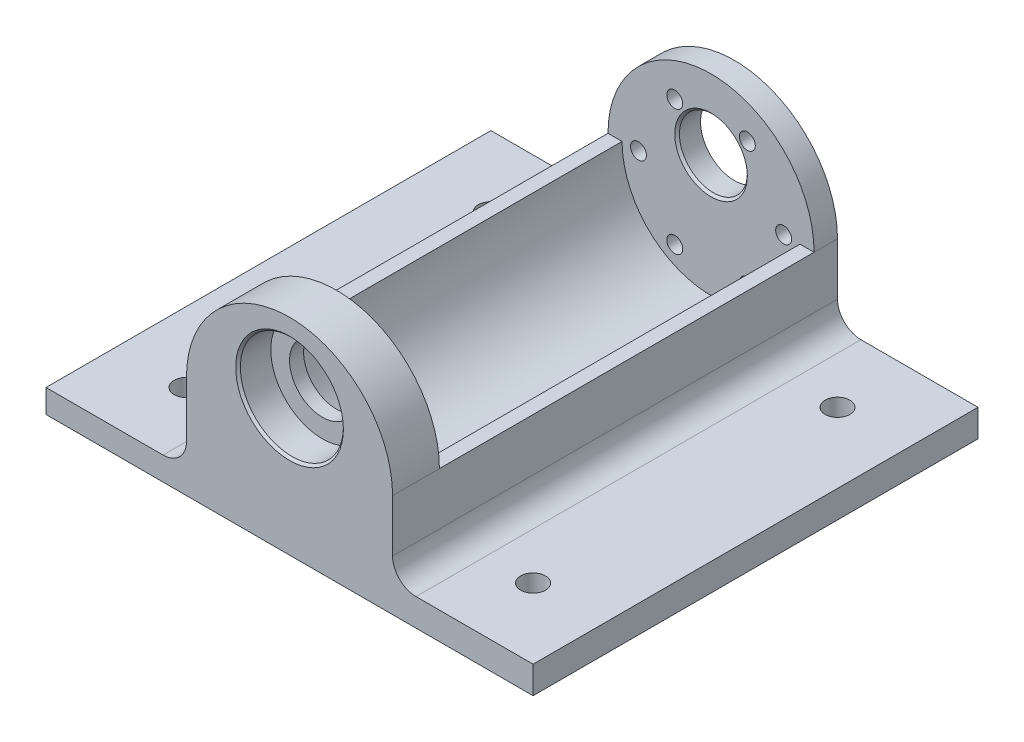
ISO-10303-21;
HEADER;
FILE_DESCRIPTION(('STEP AP214'),'2;1');
FILE_NAME('part.step','',(''),(''),'','','');
FILE_SCHEMA(('AUTOMOTIVE_DESIGN { 1 0 10303 214 1 1 1 1 }'));
ENDSEC;
DATA;
#1=APPLICATION_CONTEXT('core data for automotive mechanical design processes');
#2=APPLICATION_PROTOCOL_DEFINITION('international standard','automotive_design',2000,#1);
#3=PRODUCT_CONTEXT('',#1,'mechanical');
#4=PRODUCT('Part','Part','',(#3));
#5=PRODUCT_RELATED_PRODUCT_CATEGORY('part','',(#4));
#6=PRODUCT_DEFINITION_FORMATION('','',#4);
#7=PRODUCT_DEFINITION_CONTEXT('part definition',#1,'design');
#8=PRODUCT_DEFINITION('design','',#6,#7);
#9=PRODUCT_DEFINITION_SHAPE('','',#8);
#10=(LENGTH_UNIT() NAMED_UNIT(*) SI_UNIT(.MILLI.,.METRE.));
#11=(NAMED_UNIT(*) PLANE_ANGLE_UNIT() SI_UNIT($,.RADIAN.));
#12=(NAMED_UNIT(*) SI_UNIT($,.STERADIAN.) SOLID_ANGLE_UNIT());
#13=UNCERTAINTY_MEASURE_WITH_UNIT(LENGTH_MEASURE(1.E-05),#10,'distance_accuracy_value','');
#14=(GEOMETRIC_REPRESENTATION_CONTEXT(3) GLOBAL_UNCERTAINTY_ASSIGNED_CONTEXT((#13)) GLOBAL_UNIT_ASSIGNED_CONTEXT((#10,
#11,#12)) REPRESENTATION_CONTEXT('',''));
#15=CARTESIAN_POINT('',(0.,0.,0.));
#16=DIRECTION('',(0.,0.,1.));
#17=DIRECTION('',(1.,0.,0.));
#18=AXIS2_PLACEMENT_3D('',#15,#16,#17);
#19=CARTESIAN_POINT('',(-22.,0.,5.));
#20=DIRECTION('',(1.,0.,0.));
#21=DIRECTION('',(0.,0.,-1.));
#22=AXIS2_PLACEMENT_3D('',#19,#20,#21);
#23=PLANE('',#22);
#24=DIRECTION('',(0.,-1.,0.));
#25=VECTOR('',#24,1.);
#26=CARTESIAN_POINT('',(-22.,0.,0.));
#27=LINE('',#26,#25);
#28=CARTESIAN_POINT('',(-22.,0.,0.));
#29=VERTEX_POINT('',#28);
#30=CARTESIAN_POINT('',(-22.,-12.,0.));
#31=VERTEX_POINT('',#30);
#32=EDGE_CURVE('E164',#29,#31,#27,.T.);
#33=ORIENTED_EDGE('',*,*,#32,.T.);
#34=DIRECTION('',(0.,0.,-1.));
#35=VECTOR('',#34,1.);
#36=CARTESIAN_POINT('',(-22.,-12.,95.));
#37=LINE('',#36,#35);
#38=CARTESIAN_POINT('',(-22.,-12.,95.));
#39=VERTEX_POINT('',#38);
#40=EDGE_CURVE('E348',#31,#39,#37,.F.);
#41=ORIENTED_EDGE('',*,*,#40,.T.);
#42=DIRECTION('',(0.,-1.,0.));
#43=VECTOR('',#42,1.);
#44=CARTESIAN_POINT('',(-22.,0.,95.));
#45=LINE('',#44,#43);
#46=CARTESIAN_POINT('',(-22.,0.,95.));
#47=VERTEX_POINT('',#46);
#48=EDGE_CURVE('E219',#47,#39,#45,.T.);
#49=ORIENTED_EDGE('',*,*,#48,.F.);
#50=DIRECTION('',(0.,0.,-1.));
#51=VECTOR('',#50,1.);
#52=CARTESIAN_POINT('',(-22.,0.,95.));
#53=LINE('',#52,#51);
#54=CARTESIAN_POINT('',(-22.,0.,85.));
#55=VERTEX_POINT('',#54);
#56=EDGE_CURVE('E230',#47,#55,#53,.T.);
#57=ORIENTED_EDGE('',*,*,#56,.T.);
#58=DIRECTION('',(0.,0.,-1.));
#59=VECTOR('',#58,1.);
#60=CARTESIAN_POINT('',(-22.,0.,85.));
#61=LINE('',#60,#59);
#62=CARTESIAN_POINT('',(-22.,0.,5.));
#63=VERTEX_POINT('',#62);
#64=EDGE_CURVE('E257',#55,#63,#61,.T.);
#65=ORIENTED_EDGE('',*,*,#64,.T.);
#66=DIRECTION('',(0.,0.,-1.));
#67=VECTOR('',#66,1.);
#68=CARTESIAN_POINT('',(-22.,0.,5.));
#69=LINE('',#68,#67);
#70=EDGE_CURVE('E323',#63,#29,#69,.T.);
#71=ORIENTED_EDGE('',*,*,#70,.T.);
#72=EDGE_LOOP('',(#33,#41,#49,#57,#65,#71));
#73=FACE_BOUND('',#72,.T.);
#74=ADVANCED_FACE('F50',(#73),#23,.F.);
#75=CARTESIAN_POINT('',(22.,0.,5.));
#76=DIRECTION('',(1.,0.,0.));
#77=DIRECTION('',(0.,0.,-1.));
#78=AXIS2_PLACEMENT_3D('',#75,#76,#77);
#79=PLANE('',#78);
#80=DIRECTION('',(0.,-1.,0.));
#81=VECTOR('',#80,1.);
#82=CARTESIAN_POINT('',(22.,0.,95.));
#83=LINE('',#82,#81);
#84=CARTESIAN_POINT('',(22.,0.,95.));
#85=VERTEX_POINT('',#84);
#86=CARTESIAN_POINT('',(22.,-11.161685475024,95.));
#87=VERTEX_POINT('',#86);
#88=EDGE_CURVE('E223',#85,#87,#83,.T.);
#89=ORIENTED_EDGE('',*,*,#88,.T.);
#90=DIRECTION('',(0.,0.,1.));
#91=VECTOR('',#90,1.);
#92=CARTESIAN_POINT('',(22.,-11.161685475024,5.));
#93=LINE('',#92,#91);
#94=CARTESIAN_POINT('',(22.,-11.161685475024,0.));
#95=VERTEX_POINT('',#94);
#96=EDGE_CURVE('E66',#87,#95,#93,.F.);
#97=ORIENTED_EDGE('',*,*,#96,.T.);
#98=DIRECTION('',(0.,-1.,0.));
#99=VECTOR('',#98,1.);
#100=CARTESIAN_POINT('',(22.,0.,0.));
#101=LINE('',#100,#99);
#102=CARTESIAN_POINT('',(22.,0.,0.));
#103=VERTEX_POINT('',#102);
#104=EDGE_CURVE('E165',#103,#95,#101,.T.);
#105=ORIENTED_EDGE('',*,*,#104,.F.);
#106=DIRECTION('',(0.,0.,-1.));
#107=VECTOR('',#106,1.);
#108=CARTESIAN_POINT('',(22.,0.,5.));
#109=LINE('',#108,#107);
#110=CARTESIAN_POINT('',(22.,0.,5.));
#111=VERTEX_POINT('',#110);
#112=EDGE_CURVE('E329',#111,#103,#109,.T.);
#113=ORIENTED_EDGE('',*,*,#112,.F.);
#114=DIRECTION('',(0.,0.,-1.));
#115=VECTOR('',#114,1.);
#116=CARTESIAN_POINT('',(22.,0.,85.));
#117=LINE('',#116,#115);
#118=CARTESIAN_POINT('',(22.,0.,85.));
#119=VERTEX_POINT('',#118);
#120=EDGE_CURVE('E254',#119,#111,#117,.T.);
#121=ORIENTED_EDGE('',*,*,#120,.F.);
#122=DIRECTION('',(0.,0.,-1.));
#123=VECTOR('',#122,1.);
#124=CARTESIAN_POINT('',(22.,0.,95.));
#125=LINE('',#124,#123);
#126=EDGE_CURVE('E225',#85,#119,#125,.T.);
#127=ORIENTED_EDGE('',*,*,#126,.F.);
#128=EDGE_LOOP('',(#89,#97,#105,#113,#121,#127));
#129=FACE_BOUND('',#128,.T.);
#130=ADVANCED_FACE('F386',(#129),#79,.T.);
#131=CARTESIAN_POINT('',(0.,0.,5.));
#132=DIRECTION('',(0.,0.,1.));
#133=DIRECTION('',(1.,0.,0.));
#134=AXIS2_PLACEMENT_3D('',#131,#132,#133);
#135=PLANE('',#134);
#136=CARTESIAN_POINT('',(0.,7.,5.));
#137=DIRECTION('',(0.,0.,1.));
#138=DIRECTION('',(1.,0.,0.));
#139=AXIS2_PLACEMENT_3D('',#136,#137,#138);
#140=CIRCLE('',#139,7.74999999999999);
#141=CARTESIAN_POINT('',(7.74999999999999,7.,5.));
#142=VERTEX_POINT('',#141);
#143=EDGE_CURVE('E342',#142,#142,#140,.F.);
#144=ORIENTED_EDGE('',*,*,#143,.T.);
#145=EDGE_LOOP('',(#144));
#146=FACE_BOUND('',#145,.T.);
#147=DIRECTION('',(-1.,0.,0.));
#148=VECTOR('',#147,1.);
#149=CARTESIAN_POINT('',(19.,0.,5.));
#150=LINE('',#149,#148);
#151=CARTESIAN_POINT('',(19.,0.,5.));
#152=VERTEX_POINT('',#151);
#153=EDGE_CURVE('E238',#111,#152,#150,.T.);
#154=ORIENTED_EDGE('',*,*,#153,.F.);
#155=CARTESIAN_POINT('',(0.,0.,5.));
#156=DIRECTION('',(0.,0.,1.));
#157=DIRECTION('',(1.,0.,0.));
#158=AXIS2_PLACEMENT_3D('',#155,#156,#157);
#159=CIRCLE('',#158,22.);
#160=EDGE_CURVE('E320',#111,#63,#159,.T.);
#161=ORIENTED_EDGE('',*,*,#160,.T.);
#162=DIRECTION('',(-1.,0.,0.));
#163=VECTOR('',#162,1.);
#164=CARTESIAN_POINT('',(-19.,0.,5.));
#165=LINE('',#164,#163);
#166=CARTESIAN_POINT('',(-19.,0.,5.));
#167=VERTEX_POINT('',#166);
#168=EDGE_CURVE('E247',#167,#63,#165,.T.);
#169=ORIENTED_EDGE('',*,*,#168,.F.);
#170=CARTESIAN_POINT('',(0.,0.,5.));
#171=DIRECTION('',(0.,0.,-1.));
#172=DIRECTION('',(1.,0.,0.));
#173=AXIS2_PLACEMENT_3D('',#170,#171,#172);
#174=CIRCLE('',#173,19.);
#175=EDGE_CURVE('E233',#152,#167,#174,.T.);
#176=ORIENTED_EDGE('',*,*,#175,.F.);
#177=EDGE_LOOP('',(#154,#161,#169,#176));
#178=FACE_BOUND('',#177,.T.);
#179=CARTESIAN_POINT('',(15.5,0.,5.));
#180=DIRECTION('',(0.,0.,-1.));
#181=DIRECTION('',(-1.,0.,0.));
#182=AXIS2_PLACEMENT_3D('',#179,#180,#181);
#183=CIRCLE('',#182,1.7);
#184=CARTESIAN_POINT('',(13.8,0.,5.));
#185=VERTEX_POINT('',#184);
#186=EDGE_CURVE('E269',#185,#185,#183,.T.);
#187=ORIENTED_EDGE('',*,*,#186,.T.);
#188=EDGE_LOOP('',(#187));
#189=FACE_BOUND('',#188,.T.);
#190=CARTESIAN_POINT('',(-15.5,0.,5.));
#191=DIRECTION('',(0.,0.,-1.));
#192=DIRECTION('',(-1.,0.,0.));
#193=AXIS2_PLACEMENT_3D('',#190,#191,#192);
#194=CIRCLE('',#193,1.7);
#195=CARTESIAN_POINT('',(-17.2,0.,5.));
#196=VERTEX_POINT('',#195);
#197=EDGE_CURVE('E278',#196,#196,#194,.T.);
#198=ORIENTED_EDGE('',*,*,#197,.T.);
#199=EDGE_LOOP('',(#198));
#200=FACE_BOUND('',#199,.T.);
#201=CARTESIAN_POINT('',(-7.75,13.4233937586588,5.));
#202=DIRECTION('',(0.,0.,-1.));
#203=DIRECTION('',(-1.,0.,0.));
#204=AXIS2_PLACEMENT_3D('',#201,#202,#203);
#205=CIRCLE('',#204,1.7);
#206=CARTESIAN_POINT('',(-9.45,13.4233937586588,5.));
#207=VERTEX_POINT('',#206);
#208=EDGE_CURVE('E287',#207,#207,#205,.T.);
#209=ORIENTED_EDGE('',*,*,#208,.T.);
#210=EDGE_LOOP('',(#209));
#211=FACE_BOUND('',#210,.T.);
#212=CARTESIAN_POINT('',(7.75,13.4233937586588,5.));
#213=DIRECTION('',(0.,0.,-1.));
#214=DIRECTION('',(-1.,0.,0.));
#215=AXIS2_PLACEMENT_3D('',#212,#213,#214);
#216=CIRCLE('',#215,1.7);
#217=CARTESIAN_POINT('',(6.05,13.4233937586588,5.));
#218=VERTEX_POINT('',#217);
#219=EDGE_CURVE('E296',#218,#218,#216,.T.);
#220=ORIENTED_EDGE('',*,*,#219,.T.);
#221=EDGE_LOOP('',(#220));
#222=FACE_BOUND('',#221,.T.);
#223=CARTESIAN_POINT('',(7.75,-13.4233937586588,5.));
#224=DIRECTION('',(0.,0.,-1.));
#225=DIRECTION('',(-1.,0.,0.));
#226=AXIS2_PLACEMENT_3D('',#223,#224,#225);
#227=CIRCLE('',#226,1.7);
#228=CARTESIAN_POINT('',(6.05,-13.4233937586588,5.));
#229=VERTEX_POINT('',#228);
#230=EDGE_CURVE('E305',#229,#229,#227,.T.);
#231=ORIENTED_EDGE('',*,*,#230,.T.);
#232=EDGE_LOOP('',(#231));
#233=FACE_BOUND('',#232,.T.);
#234=CARTESIAN_POINT('',(-7.75,-13.4233937586588,5.));
#235=DIRECTION('',(0.,0.,-1.));
#236=DIRECTION('',(-1.,0.,0.));
#237=AXIS2_PLACEMENT_3D('',#234,#235,#236);
#238=CIRCLE('',#237,1.7);
#239=CARTESIAN_POINT('',(-9.45,-13.4233937586588,5.));
#240=VERTEX_POINT('',#239);
#241=EDGE_CURVE('E314',#240,#240,#238,.T.);
#242=ORIENTED_EDGE('',*,*,#241,.T.);
#243=EDGE_LOOP('',(#242));
#244=FACE_BOUND('',#243,.T.);
#245=ADVANCED_FACE('F374',(#146,#178,#189,#200,#211,#222,#233,#244),#135,.T.);
#246=CARTESIAN_POINT('',(0.,0.,0.));
#247=DIRECTION('',(0.,0.,1.));
#248=DIRECTION('',(1.,0.,0.));
#249=AXIS2_PLACEMENT_3D('',#246,#247,#248);
#250=PLANE('',#249);
#251=CARTESIAN_POINT('',(15.5,0.,0.));
#252=DIRECTION('',(0.,0.,-1.));
#253=DIRECTION('',(-1.,0.,0.));
#254=AXIS2_PLACEMENT_3D('',#251,#252,#253);
#255=CIRCLE('',#254,1.725);
#256=CARTESIAN_POINT('',(13.775,0.,0.));
#257=VERTEX_POINT('',#256);
#258=EDGE_CURVE('E263',#257,#257,#255,.T.);
#259=ORIENTED_EDGE('',*,*,#258,.F.);
#260=EDGE_LOOP('',(#259));
#261=FACE_BOUND('',#260,.T.);
#262=CARTESIAN_POINT('',(-15.5,0.,0.));
#263=DIRECTION('',(0.,0.,-1.));
#264=DIRECTION('',(-1.,0.,0.));
#265=AXIS2_PLACEMENT_3D('',#262,#263,#264);
#266=CIRCLE('',#265,1.725);
#267=CARTESIAN_POINT('',(-17.225,0.,0.));
#268=VERTEX_POINT('',#267);
#269=EDGE_CURVE('E272',#268,#268,#266,.T.);
#270=ORIENTED_EDGE('',*,*,#269,.F.);
#271=EDGE_LOOP('',(#270));
#272=FACE_BOUND('',#271,.T.);
#273=CARTESIAN_POINT('',(-7.75,13.4233937586588,0.));
#274=DIRECTION('',(0.,0.,-1.));
#275=DIRECTION('',(-1.,0.,0.));
#276=AXIS2_PLACEMENT_3D('',#273,#274,#275);
#277=CIRCLE('',#276,1.725);
#278=CARTESIAN_POINT('',(-9.475,13.4233937586588,0.));
#279=VERTEX_POINT('',#278);
#280=EDGE_CURVE('E281',#279,#279,#277,.T.);
#281=ORIENTED_EDGE('',*,*,#280,.F.);
#282=EDGE_LOOP('',(#281));
#283=FACE_BOUND('',#282,.T.);
#284=CARTESIAN_POINT('',(7.75,13.4233937586588,0.));
#285=DIRECTION('',(0.,0.,-1.));
#286=DIRECTION('',(-1.,0.,0.));
#287=AXIS2_PLACEMENT_3D('',#284,#285,#286);
#288=CIRCLE('',#287,1.725);
#289=CARTESIAN_POINT('',(6.025,13.4233937586588,0.));
#290=VERTEX_POINT('',#289);
#291=EDGE_CURVE('E290',#290,#290,#288,.T.);
#292=ORIENTED_EDGE('',*,*,#291,.F.);
#293=EDGE_LOOP('',(#292));
#294=FACE_BOUND('',#293,.T.);
#295=CARTESIAN_POINT('',(7.75,-13.4233937586588,0.));
#296=DIRECTION('',(0.,0.,-1.));
#297=DIRECTION('',(-1.,0.,0.));
#298=AXIS2_PLACEMENT_3D('',#295,#296,#297);
#299=CIRCLE('',#298,1.725);
#300=CARTESIAN_POINT('',(6.025,-13.4233937586588,0.));
#301=VERTEX_POINT('',#300);
#302=EDGE_CURVE('E299',#301,#301,#299,.T.);
#303=ORIENTED_EDGE('',*,*,#302,.F.);
#304=EDGE_LOOP('',(#303));
#305=FACE_BOUND('',#304,.T.);
#306=ORIENTED_EDGE('',*,*,#104,.T.);
#307=CARTESIAN_POINT('',(27.,-11.161685475024,0.));
#308=DIRECTION('',(0.,0.,1.));
#309=DIRECTION('',(1.,0.,0.));
#310=AXIS2_PLACEMENT_3D('',#307,#308,#309);
#311=CIRCLE('',#310,5.);
#312=CARTESIAN_POINT('',(27.,-16.161685475024,0.));
#313=VERTEX_POINT('',#312);
#314=EDGE_CURVE('E12',#95,#313,#311,.T.);
#315=ORIENTED_EDGE('',*,*,#314,.T.);
#316=DIRECTION('',(-1.,0.,0.));
#317=VECTOR('',#316,1.);
#318=CARTESIAN_POINT('',(52.,-16.161685475024,0.));
#319=LINE('',#318,#317);
#320=CARTESIAN_POINT('',(52.,-16.161685475024,0.));
#321=VERTEX_POINT('',#320);
#322=EDGE_CURVE('E203',#321,#313,#319,.T.);
#323=ORIENTED_EDGE('',*,*,#322,.F.);
#324=DIRECTION('',(0.,1.,0.));
#325=VECTOR('',#324,1.);
#326=CARTESIAN_POINT('',(52.,-22.,0.));
#327=LINE('',#326,#325);
#328=CARTESIAN_POINT('',(52.,-22.,0.));
#329=VERTEX_POINT('',#328);
#330=EDGE_CURVE('E160',#329,#321,#327,.T.);
#331=ORIENTED_EDGE('',*,*,#330,.F.);
#332=DIRECTION('',(-1.,0.,0.));
#333=VECTOR('',#332,1.);
#334=CARTESIAN_POINT('',(22.,-22.,0.));
#335=LINE('',#334,#333);
#336=CARTESIAN_POINT('',(-52.,-22.,0.));
#337=VERTEX_POINT('',#336);
#338=EDGE_CURVE('E152',#329,#337,#335,.T.);
#339=ORIENTED_EDGE('',*,*,#338,.T.);
#340=DIRECTION('',(0.,-1.,0.));
#341=VECTOR('',#340,1.);
#342=CARTESIAN_POINT('',(-52.,-22.,0.));
#343=LINE('',#342,#341);
#344=CARTESIAN_POINT('',(-52.,-17.,0.));
#345=VERTEX_POINT('',#344);
#346=EDGE_CURVE('E158',#345,#337,#343,.T.);
#347=ORIENTED_EDGE('',*,*,#346,.F.);
#348=DIRECTION('',(1.,0.,0.));
#349=VECTOR('',#348,1.);
#350=CARTESIAN_POINT('',(-52.,-17.,0.));
#351=LINE('',#350,#349);
#352=CARTESIAN_POINT('',(-27.,-17.,0.));
#353=VERTEX_POINT('',#352);
#354=EDGE_CURVE('E188',#345,#353,#351,.T.);
#355=ORIENTED_EDGE('',*,*,#354,.T.);
#356=CARTESIAN_POINT('',(-27.,-12.,0.));
#357=DIRECTION('',(0.,0.,1.));
#358=DIRECTION('',(1.,0.,0.));
#359=AXIS2_PLACEMENT_3D('',#356,#357,#358);
#360=CIRCLE('',#359,5.);
#361=EDGE_CURVE('E354',#353,#31,#360,.T.);
#362=ORIENTED_EDGE('',*,*,#361,.T.);
#363=ORIENTED_EDGE('',*,*,#32,.F.);
#364=CARTESIAN_POINT('',(0.,0.,0.));
#365=DIRECTION('',(0.,0.,1.));
#366=DIRECTION('',(1.,0.,0.));
#367=AXIS2_PLACEMENT_3D('',#364,#365,#366);
#368=CIRCLE('',#367,22.);
#369=EDGE_CURVE('E324',#103,#29,#368,.T.);
#370=ORIENTED_EDGE('',*,*,#369,.F.);
#371=EDGE_LOOP('',(#306,#315,#323,#331,#339,#347,#355,#362,#363,#370));
#372=FACE_BOUND('',#371,.T.);
#373=CARTESIAN_POINT('',(0.,7.,0.));
#374=DIRECTION('',(0.,0.,1.));
#375=DIRECTION('',(1.,0.,0.));
#376=AXIS2_PLACEMENT_3D('',#373,#374,#375);
#377=CIRCLE('',#376,7.25);
#378=CARTESIAN_POINT('',(7.25,7.,0.));
#379=VERTEX_POINT('',#378);
#380=EDGE_CURVE('E317',#379,#379,#377,.T.);
#381=ORIENTED_EDGE('',*,*,#380,.T.);
#382=EDGE_LOOP('',(#381));
#383=FACE_BOUND('',#382,.T.);
#384=CARTESIAN_POINT('',(-7.75,-13.4233937586588,0.));
#385=DIRECTION('',(0.,0.,-1.));
#386=DIRECTION('',(-1.,0.,0.));
#387=AXIS2_PLACEMENT_3D('',#384,#385,#386);
#388=CIRCLE('',#387,1.725);
#389=CARTESIAN_POINT('',(-9.475,-13.4233937586588,0.));
#390=VERTEX_POINT('',#389);
#391=EDGE_CURVE('E308',#390,#390,#388,.T.);
#392=ORIENTED_EDGE('',*,*,#391,.F.);
#393=EDGE_LOOP('',(#392));
#394=FACE_BOUND('',#393,.T.);
#395=ADVANCED_FACE('F154',(#261,#272,#283,#294,#305,#372,#383,#394),#250,.F.);
#396=CARTESIAN_POINT('',(0.,0.,5.));
#397=DIRECTION('',(0.,0.,-1.));
#398=DIRECTION('',(-1.,0.,0.));
#399=AXIS2_PLACEMENT_3D('',#396,#397,#398);
#400=CYLINDRICAL_SURFACE('',#399,22.);
#401=ORIENTED_EDGE('',*,*,#369,.T.);
#402=ORIENTED_EDGE('',*,*,#70,.F.);
#403=ORIENTED_EDGE('',*,*,#160,.F.);
#404=ORIENTED_EDGE('',*,*,#112,.T.);
#405=EDGE_LOOP('',(#401,#402,#403,#404));
#406=FACE_BOUND('',#405,.T.);
#407=ADVANCED_FACE('F372',(#406),#400,.T.);
#408=CARTESIAN_POINT('',(22.,-22.,5.));
#409=DIRECTION('',(0.,-1.,0.));
#410=DIRECTION('',(0.,0.,-1.));
#411=AXIS2_PLACEMENT_3D('',#408,#409,#410);
#412=PLANE('',#411);
#413=CARTESIAN_POINT('',(-37.,-22.,80.));
#414=DIRECTION('',(0.,-1.,0.));
#415=DIRECTION('',(0.,0.,-1.));
#416=AXIS2_PLACEMENT_3D('',#413,#414,#415);
#417=CIRCLE('',#416,2.64999999999999);
#418=CARTESIAN_POINT('',(-37.,-22.,77.35));
#419=VERTEX_POINT('',#418);
#420=EDGE_CURVE('E458',#419,#419,#417,.T.);
#421=ORIENTED_EDGE('',*,*,#420,.F.);
#422=EDGE_LOOP('',(#421));
#423=FACE_BOUND('',#422,.T.);
#424=CARTESIAN_POINT('',(37.,-22.,80.));
#425=DIRECTION('',(0.,-1.,0.));
#426=DIRECTION('',(0.,0.,-1.));
#427=AXIS2_PLACEMENT_3D('',#424,#425,#426);
#428=CIRCLE('',#427,2.64999999999999);
#429=CARTESIAN_POINT('',(37.,-22.,77.35));
#430=VERTEX_POINT('',#429);
#431=EDGE_CURVE('E461',#430,#430,#428,.T.);
#432=ORIENTED_EDGE('',*,*,#431,.F.);
#433=EDGE_LOOP('',(#432));
#434=FACE_BOUND('',#433,.T.);
#435=CARTESIAN_POINT('',(37.,-22.,15.));
#436=DIRECTION('',(0.,-1.,0.));
#437=DIRECTION('',(0.,0.,-1.));
#438=AXIS2_PLACEMENT_3D('',#435,#436,#437);
#439=CIRCLE('',#438,2.64999999999999);
#440=CARTESIAN_POINT('',(37.,-22.,12.35));
#441=VERTEX_POINT('',#440);
#442=EDGE_CURVE('E469',#441,#441,#439,.T.);
#443=ORIENTED_EDGE('',*,*,#442,.F.);
#444=EDGE_LOOP('',(#443));
#445=FACE_BOUND('',#444,.T.);
#446=CARTESIAN_POINT('',(-37.,-22.,15.));
#447=DIRECTION('',(0.,-1.,0.));
#448=DIRECTION('',(0.,0.,-1.));
#449=AXIS2_PLACEMENT_3D('',#446,#447,#448);
#450=CIRCLE('',#449,2.64999999999999);
#451=CARTESIAN_POINT('',(-37.,-22.,12.35));
#452=VERTEX_POINT('',#451);
#453=EDGE_CURVE('E182',#452,#452,#450,.T.);
#454=ORIENTED_EDGE('',*,*,#453,.F.);
#455=EDGE_LOOP('',(#454));
#456=FACE_BOUND('',#455,.T.);
#457=ORIENTED_EDGE('',*,*,#338,.F.);
#458=DIRECTION('',(0.,0.,-1.));
#459=VECTOR('',#458,1.);
#460=CARTESIAN_POINT('',(52.,-22.,95.));
#461=LINE('',#460,#459);
#462=CARTESIAN_POINT('',(52.,-22.,95.));
#463=VERTEX_POINT('',#462);
#464=EDGE_CURVE('E196',#463,#329,#461,.T.);
#465=ORIENTED_EDGE('',*,*,#464,.F.);
#466=DIRECTION('',(-1.,0.,0.));
#467=VECTOR('',#466,1.);
#468=CARTESIAN_POINT('',(22.,-22.,95.));
#469=LINE('',#468,#467);
#470=CARTESIAN_POINT('',(-52.,-22.,95.));
#471=VERTEX_POINT('',#470);
#472=EDGE_CURVE('E170',#463,#471,#469,.T.);
#473=ORIENTED_EDGE('',*,*,#472,.T.);
#474=DIRECTION('',(0.,0.,1.));
#475=VECTOR('',#474,1.);
#476=CARTESIAN_POINT('',(-52.,-22.,0.));
#477=LINE('',#476,#475);
#478=EDGE_CURVE('E168',#337,#471,#477,.T.);
#479=ORIENTED_EDGE('',*,*,#478,.F.);
#480=EDGE_LOOP('',(#457,#465,#473,#479));
#481=FACE_BOUND('',#480,.T.);
#482=ADVANCED_FACE('F169',(#423,#434,#445,#456,#481),#412,.T.);
#483=CARTESIAN_POINT('',(0.,7.,5.));
#484=DIRECTION('',(0.,0.,-1.));
#485=DIRECTION('',(-1.,0.,0.));
#486=AXIS2_PLACEMENT_3D('',#483,#484,#485);
#487=CYLINDRICAL_SURFACE('',#486,7.25);
#488=CARTESIAN_POINT('',(0.,7.,4.5));
#489=DIRECTION('',(0.,0.,1.));
#490=DIRECTION('',(1.,0.,0.));
#491=AXIS2_PLACEMENT_3D('',#488,#489,#490);
#492=CIRCLE('',#491,7.25);
#493=CARTESIAN_POINT('',(7.25,7.,4.5));
#494=VERTEX_POINT('',#493);
#495=EDGE_CURVE('E339',#494,#494,#492,.T.);
#496=ORIENTED_EDGE('',*,*,#495,.T.);
#497=EDGE_LOOP('',(#496));
#498=FACE_BOUND('',#497,.T.);
#499=ORIENTED_EDGE('',*,*,#380,.F.);
#500=EDGE_LOOP('',(#499));
#501=FACE_BOUND('',#500,.T.);
#502=ADVANCED_FACE('F419',(#498,#501),#487,.F.);
#503=CARTESIAN_POINT('',(-7.75,-13.4233937586588,0.));
#504=DIRECTION('',(0.,0.,-1.));
#505=DIRECTION('',(-1.,0.,0.));
#506=AXIS2_PLACEMENT_3D('',#503,#504,#505);
#507=CYLINDRICAL_SURFACE('',#506,1.7);
#508=ORIENTED_EDGE('',*,*,#241,.F.);
#509=EDGE_LOOP('',(#508));
#510=FACE_BOUND('',#509,.T.);
#511=CARTESIAN_POINT('',(-7.75,-13.4233937586588,0.0250000000000025));
#512=DIRECTION('',(0.,0.,-1.));
#513=DIRECTION('',(-1.,0.,0.));
#514=AXIS2_PLACEMENT_3D('',#511,#512,#513);
#515=CIRCLE('',#514,1.7);
#516=CARTESIAN_POINT('',(-9.45,-13.4233937586588,0.0250000000000025));
#517=VERTEX_POINT('',#516);
#518=EDGE_CURVE('E311',#517,#517,#515,.T.);
#519=ORIENTED_EDGE('',*,*,#518,.T.);
#520=EDGE_LOOP('',(#519));
#521=FACE_BOUND('',#520,.T.);
#522=ADVANCED_FACE('F623',(#510,#521),#507,.F.);
#523=CARTESIAN_POINT('',(-7.75,-13.4233937586588,0.));
#524=DIRECTION('',(0.,0.,-1.));
#525=DIRECTION('',(-1.,0.,0.));
#526=AXIS2_PLACEMENT_3D('',#523,#524,#525);
#527=CONICAL_SURFACE('',#526,1.725,0.785398163397414);
#528=ORIENTED_EDGE('',*,*,#518,.F.);
#529=EDGE_LOOP('',(#528));
#530=FACE_BOUND('',#529,.T.);
#531=ORIENTED_EDGE('',*,*,#391,.T.);
#532=EDGE_LOOP('',(#531));
#533=FACE_BOUND('',#532,.T.);
#534=ADVANCED_FACE('F646',(#530,#533),#527,.F.);
#535=CARTESIAN_POINT('',(7.75,-13.4233937586588,0.));
#536=DIRECTION('',(0.,0.,-1.));
#537=DIRECTION('',(-1.,0.,0.));
#538=AXIS2_PLACEMENT_3D('',#535,#536,#537);
#539=CYLINDRICAL_SURFACE('',#538,1.7);
#540=ORIENTED_EDGE('',*,*,#230,.F.);
#541=EDGE_LOOP('',(#540));
#542=FACE_BOUND('',#541,.T.);
#543=CARTESIAN_POINT('',(7.75,-13.4233937586588,0.0250000000000025));
#544=DIRECTION('',(0.,0.,-1.));
#545=DIRECTION('',(-1.,0.,0.));
#546=AXIS2_PLACEMENT_3D('',#543,#544,#545);
#547=CIRCLE('',#546,1.7);
#548=CARTESIAN_POINT('',(6.05,-13.4233937586588,0.0250000000000025));
#549=VERTEX_POINT('',#548);
#550=EDGE_CURVE('E302',#549,#549,#547,.T.);
#551=ORIENTED_EDGE('',*,*,#550,.T.);
#552=EDGE_LOOP('',(#551));
#553=FACE_BOUND('',#552,.T.);
#554=ADVANCED_FACE('F655',(#542,#553),#539,.F.);
#555=CARTESIAN_POINT('',(7.75,-13.4233937586588,0.));
#556=DIRECTION('',(0.,0.,-1.));
#557=DIRECTION('',(-1.,0.,0.));
#558=AXIS2_PLACEMENT_3D('',#555,#556,#557);
#559=CONICAL_SURFACE('',#558,1.725,0.785398163397414);
#560=ORIENTED_EDGE('',*,*,#550,.F.);
#561=EDGE_LOOP('',(#560));
#562=FACE_BOUND('',#561,.T.);
#563=ORIENTED_EDGE('',*,*,#302,.T.);
#564=EDGE_LOOP('',(#563));
#565=FACE_BOUND('',#564,.T.);
#566=ADVANCED_FACE('F664',(#562,#565),#559,.F.);
#567=CARTESIAN_POINT('',(7.75,13.4233937586588,0.));
#568=DIRECTION('',(0.,0.,-1.));
#569=DIRECTION('',(-1.,0.,0.));
#570=AXIS2_PLACEMENT_3D('',#567,#568,#569);
#571=CYLINDRICAL_SURFACE('',#570,1.7);
#572=ORIENTED_EDGE('',*,*,#219,.F.);
#573=EDGE_LOOP('',(#572));
#574=FACE_BOUND('',#573,.T.);
#575=CARTESIAN_POINT('',(7.75,13.4233937586588,0.0250000000000025));
#576=DIRECTION('',(0.,0.,-1.));
#577=DIRECTION('',(-1.,0.,0.));
#578=AXIS2_PLACEMENT_3D('',#575,#576,#577);
#579=CIRCLE('',#578,1.7);
#580=CARTESIAN_POINT('',(6.05,13.4233937586588,0.0250000000000025));
#581=VERTEX_POINT('',#580);
#582=EDGE_CURVE('E293',#581,#581,#579,.T.);
#583=ORIENTED_EDGE('',*,*,#582,.T.);
#584=EDGE_LOOP('',(#583));
#585=FACE_BOUND('',#584,.T.);
#586=ADVANCED_FACE('F673',(#574,#585),#571,.F.);
#587=CARTESIAN_POINT('',(7.75,13.4233937586588,0.));
#588=DIRECTION('',(0.,0.,-1.));
#589=DIRECTION('',(-1.,0.,0.));
#590=AXIS2_PLACEMENT_3D('',#587,#588,#589);
#591=CONICAL_SURFACE('',#590,1.725,0.785398163397414);
#592=ORIENTED_EDGE('',*,*,#582,.F.);
#593=EDGE_LOOP('',(#592));
#594=FACE_BOUND('',#593,.T.);
#595=ORIENTED_EDGE('',*,*,#291,.T.);
#596=EDGE_LOOP('',(#595));
#597=FACE_BOUND('',#596,.T.);
#598=ADVANCED_FACE('F682',(#594,#597),#591,.F.);
#599=CARTESIAN_POINT('',(-7.75,13.4233937586588,0.));
#600=DIRECTION('',(0.,0.,-1.));
#601=DIRECTION('',(-1.,0.,0.));
#602=AXIS2_PLACEMENT_3D('',#599,#600,#601);
#603=CYLINDRICAL_SURFACE('',#602,1.7);
#604=ORIENTED_EDGE('',*,*,#208,.F.);
#605=EDGE_LOOP('',(#604));
#606=FACE_BOUND('',#605,.T.);
#607=CARTESIAN_POINT('',(-7.75,13.4233937586588,0.0250000000000025));
#608=DIRECTION('',(0.,0.,-1.));
#609=DIRECTION('',(-1.,0.,0.));
#610=AXIS2_PLACEMENT_3D('',#607,#608,#609);
#611=CIRCLE('',#610,1.7);
#612=CARTESIAN_POINT('',(-9.45,13.4233937586588,0.0250000000000025));
#613=VERTEX_POINT('',#612);
#614=EDGE_CURVE('E284',#613,#613,#611,.T.);
#615=ORIENTED_EDGE('',*,*,#614,.T.);
#616=EDGE_LOOP('',(#615));
#617=FACE_BOUND('',#616,.T.);
#618=ADVANCED_FACE('F691',(#606,#617),#603,.F.);
#619=CARTESIAN_POINT('',(-7.75,13.4233937586588,0.));
#620=DIRECTION('',(0.,0.,-1.));
#621=DIRECTION('',(-1.,0.,0.));
#622=AXIS2_PLACEMENT_3D('',#619,#620,#621);
#623=CONICAL_SURFACE('',#622,1.725,0.785398163397414);
#624=ORIENTED_EDGE('',*,*,#614,.F.);
#625=EDGE_LOOP('',(#624));
#626=FACE_BOUND('',#625,.T.);
#627=ORIENTED_EDGE('',*,*,#280,.T.);
#628=EDGE_LOOP('',(#627));
#629=FACE_BOUND('',#628,.T.);
#630=ADVANCED_FACE('F700',(#626,#629),#623,.F.);
#631=CARTESIAN_POINT('',(-15.5,0.,0.));
#632=DIRECTION('',(0.,0.,-1.));
#633=DIRECTION('',(-1.,0.,0.));
#634=AXIS2_PLACEMENT_3D('',#631,#632,#633);
#635=CYLINDRICAL_SURFACE('',#634,1.7);
#636=ORIENTED_EDGE('',*,*,#197,.F.);
#637=EDGE_LOOP('',(#636));
#638=FACE_BOUND('',#637,.T.);
#639=CARTESIAN_POINT('',(-15.5,0.,0.0250000000000025));
#640=DIRECTION('',(0.,0.,-1.));
#641=DIRECTION('',(-1.,0.,0.));
#642=AXIS2_PLACEMENT_3D('',#639,#640,#641);
#643=CIRCLE('',#642,1.7);
#644=CARTESIAN_POINT('',(-17.2,0.,0.0250000000000025));
#645=VERTEX_POINT('',#644);
#646=EDGE_CURVE('E275',#645,#645,#643,.T.);
#647=ORIENTED_EDGE('',*,*,#646,.T.);
#648=EDGE_LOOP('',(#647));
#649=FACE_BOUND('',#648,.T.);
#650=ADVANCED_FACE('F709',(#638,#649),#635,.F.);
#651=CARTESIAN_POINT('',(-15.5,0.,0.));
#652=DIRECTION('',(0.,0.,-1.));
#653=DIRECTION('',(-1.,0.,0.));
#654=AXIS2_PLACEMENT_3D('',#651,#652,#653);
#655=CONICAL_SURFACE('',#654,1.725,0.785398163397414);
#656=ORIENTED_EDGE('',*,*,#646,.F.);
#657=EDGE_LOOP('',(#656));
#658=FACE_BOUND('',#657,.T.);
#659=ORIENTED_EDGE('',*,*,#269,.T.);
#660=EDGE_LOOP('',(#659));
#661=FACE_BOUND('',#660,.T.);
#662=ADVANCED_FACE('F718',(#658,#661),#655,.F.);
#663=CARTESIAN_POINT('',(15.5,0.,0.));
#664=DIRECTION('',(0.,0.,-1.));
#665=DIRECTION('',(-1.,0.,0.));
#666=AXIS2_PLACEMENT_3D('',#663,#664,#665);
#667=CYLINDRICAL_SURFACE('',#666,1.7);
#668=ORIENTED_EDGE('',*,*,#186,.F.);
#669=EDGE_LOOP('',(#668));
#670=FACE_BOUND('',#669,.T.);
#671=CARTESIAN_POINT('',(15.5,0.,0.0250000000000025));
#672=DIRECTION('',(0.,0.,-1.));
#673=DIRECTION('',(-1.,0.,0.));
#674=AXIS2_PLACEMENT_3D('',#671,#672,#673);
#675=CIRCLE('',#674,1.7);
#676=CARTESIAN_POINT('',(13.8,0.,0.0250000000000025));
#677=VERTEX_POINT('',#676);
#678=EDGE_CURVE('E266',#677,#677,#675,.T.);
#679=ORIENTED_EDGE('',*,*,#678,.T.);
#680=EDGE_LOOP('',(#679));
#681=FACE_BOUND('',#680,.T.);
#682=ADVANCED_FACE('F727',(#670,#681),#667,.F.);
#683=CARTESIAN_POINT('',(15.5,0.,0.));
#684=DIRECTION('',(0.,0.,-1.));
#685=DIRECTION('',(-1.,0.,0.));
#686=AXIS2_PLACEMENT_3D('',#683,#684,#685);
#687=CONICAL_SURFACE('',#686,1.725,0.785398163397379);
#688=ORIENTED_EDGE('',*,*,#678,.F.);
#689=EDGE_LOOP('',(#688));
#690=FACE_BOUND('',#689,.T.);
#691=ORIENTED_EDGE('',*,*,#258,.T.);
#692=EDGE_LOOP('',(#691));
#693=FACE_BOUND('',#692,.T.);
#694=ADVANCED_FACE('F736',(#690,#693),#687,.F.);
#695=CARTESIAN_POINT('',(0.,0.,85.));
#696=DIRECTION('',(0.,0.,-1.));
#697=DIRECTION('',(-1.,0.,0.));
#698=AXIS2_PLACEMENT_3D('',#695,#696,#697);
#699=CYLINDRICAL_SURFACE('',#698,19.);
#700=ORIENTED_EDGE('',*,*,#175,.T.);
#701=DIRECTION('',(0.,0.,-1.));
#702=VECTOR('',#701,1.);
#703=CARTESIAN_POINT('',(-19.,0.,85.));
#704=LINE('',#703,#702);
#705=CARTESIAN_POINT('',(-19.,0.,85.));
#706=VERTEX_POINT('',#705);
#707=EDGE_CURVE('E260',#706,#167,#704,.T.);
#708=ORIENTED_EDGE('',*,*,#707,.F.);
#709=CARTESIAN_POINT('',(0.,0.,85.));
#710=DIRECTION('',(0.,0.,-1.));
#711=DIRECTION('',(1.,0.,0.));
#712=AXIS2_PLACEMENT_3D('',#709,#710,#711);
#713=CIRCLE('',#712,19.);
#714=CARTESIAN_POINT('',(19.,0.,85.));
#715=VERTEX_POINT('',#714);
#716=EDGE_CURVE('E234',#715,#706,#713,.T.);
#717=ORIENTED_EDGE('',*,*,#716,.F.);
#718=DIRECTION('',(0.,0.,-1.));
#719=VECTOR('',#718,1.);
#720=CARTESIAN_POINT('',(19.,0.,85.));
#721=LINE('',#720,#719);
#722=EDGE_CURVE('E244',#715,#152,#721,.T.);
#723=ORIENTED_EDGE('',*,*,#722,.T.);
#724=EDGE_LOOP('',(#700,#708,#717,#723));
#725=FACE_BOUND('',#724,.T.);
#726=ADVANCED_FACE('F381',(#725),#699,.F.);
#727=CARTESIAN_POINT('',(-19.,0.,85.));
#728=DIRECTION('',(0.,-1.,0.));
#729=DIRECTION('',(1.,0.,0.));
#730=AXIS2_PLACEMENT_3D('',#727,#728,#729);
#731=PLANE('',#730);
#732=ORIENTED_EDGE('',*,*,#168,.T.);
#733=ORIENTED_EDGE('',*,*,#64,.F.);
#734=DIRECTION('',(-1.,0.,0.));
#735=VECTOR('',#734,1.);
#736=CARTESIAN_POINT('',(-19.,0.,85.));
#737=LINE('',#736,#735);
#738=EDGE_CURVE('E237',#706,#55,#737,.T.);
#739=ORIENTED_EDGE('',*,*,#738,.F.);
#740=ORIENTED_EDGE('',*,*,#707,.T.);
#741=EDGE_LOOP('',(#732,#733,#739,#740));
#742=FACE_BOUND('',#741,.T.);
#743=ADVANCED_FACE('F378',(#742),#731,.F.);
#744=CARTESIAN_POINT('',(19.,0.,85.));
#745=DIRECTION('',(0.,-1.,0.));
#746=DIRECTION('',(0.,0.,-1.));
#747=AXIS2_PLACEMENT_3D('',#744,#745,#746);
#748=PLANE('',#747);
#749=ORIENTED_EDGE('',*,*,#153,.T.);
#750=ORIENTED_EDGE('',*,*,#722,.F.);
#751=DIRECTION('',(-1.,0.,0.));
#752=VECTOR('',#751,1.);
#753=CARTESIAN_POINT('',(19.,0.,85.));
#754=LINE('',#753,#752);
#755=EDGE_CURVE('E241',#119,#715,#754,.T.);
#756=ORIENTED_EDGE('',*,*,#755,.F.);
#757=ORIENTED_EDGE('',*,*,#120,.T.);
#758=EDGE_LOOP('',(#749,#750,#756,#757));
#759=FACE_BOUND('',#758,.T.);
#760=ADVANCED_FACE('F384',(#759),#748,.F.);
#761=CARTESIAN_POINT('',(0.,0.,95.));
#762=DIRECTION('',(0.,0.,-1.));
#763=DIRECTION('',(-1.,0.,0.));
#764=AXIS2_PLACEMENT_3D('',#761,#762,#763);
#765=CYLINDRICAL_SURFACE('',#764,22.);
#766=CARTESIAN_POINT('',(0.,0.,85.));
#767=DIRECTION('',(0.,0.,1.));
#768=DIRECTION('',(1.,0.,0.));
#769=AXIS2_PLACEMENT_3D('',#766,#767,#768);
#770=CIRCLE('',#769,22.);
#771=EDGE_CURVE('E215',#119,#55,#770,.T.);
#772=ORIENTED_EDGE('',*,*,#771,.T.);
#773=ORIENTED_EDGE('',*,*,#56,.F.);
#774=CARTESIAN_POINT('',(0.,0.,95.));
#775=DIRECTION('',(0.,0.,1.));
#776=DIRECTION('',(1.,0.,0.));
#777=AXIS2_PLACEMENT_3D('',#774,#775,#776);
#778=CIRCLE('',#777,22.);
#779=EDGE_CURVE('E216',#85,#47,#778,.T.);
#780=ORIENTED_EDGE('',*,*,#779,.F.);
#781=ORIENTED_EDGE('',*,*,#126,.T.);
#782=EDGE_LOOP('',(#772,#773,#780,#781));
#783=FACE_BOUND('',#782,.T.);
#784=ADVANCED_FACE('F571',(#783),#765,.T.);
#785=CARTESIAN_POINT('',(0.,0.,95.));
#786=DIRECTION('',(0.,0.,1.));
#787=DIRECTION('',(1.,0.,0.));
#788=AXIS2_PLACEMENT_3D('',#785,#786,#787);
#789=PLANE('',#788);
#790=CARTESIAN_POINT('',(0.,7.,95.));
#791=DIRECTION('',(0.,0.,1.));
#792=DIRECTION('',(1.,0.,0.));
#793=AXIS2_PLACEMENT_3D('',#790,#791,#792);
#794=CIRCLE('',#793,11.5);
#795=CARTESIAN_POINT('',(11.5,7.,95.));
#796=VERTEX_POINT('',#795);
#797=EDGE_CURVE('E336',#796,#796,#794,.F.);
#798=ORIENTED_EDGE('',*,*,#797,.T.);
#799=EDGE_LOOP('',(#798));
#800=FACE_BOUND('',#799,.T.);
#801=ORIENTED_EDGE('',*,*,#779,.T.);
#802=ORIENTED_EDGE('',*,*,#48,.T.);
#803=CARTESIAN_POINT('',(-27.,-12.,95.));
#804=DIRECTION('',(0.,0.,1.));
#805=DIRECTION('',(1.,0.,0.));
#806=AXIS2_PLACEMENT_3D('',#803,#804,#805);
#807=CIRCLE('',#806,5.);
#808=CARTESIAN_POINT('',(-27.,-17.,95.));
#809=VERTEX_POINT('',#808);
#810=EDGE_CURVE('E356',#39,#809,#807,.F.);
#811=ORIENTED_EDGE('',*,*,#810,.T.);
#812=DIRECTION('',(1.,0.,0.));
#813=VECTOR('',#812,1.);
#814=CARTESIAN_POINT('',(-52.,-17.,95.));
#815=LINE('',#814,#813);
#816=CARTESIAN_POINT('',(-52.,-17.,95.));
#817=VERTEX_POINT('',#816);
#818=EDGE_CURVE('E190',#817,#809,#815,.T.);
#819=ORIENTED_EDGE('',*,*,#818,.F.);
#820=DIRECTION('',(0.,1.,0.));
#821=VECTOR('',#820,1.);
#822=CARTESIAN_POINT('',(-52.,-22.,95.));
#823=LINE('',#822,#821);
#824=EDGE_CURVE('E173',#471,#817,#823,.T.);
#825=ORIENTED_EDGE('',*,*,#824,.F.);
#826=ORIENTED_EDGE('',*,*,#472,.F.);
#827=DIRECTION('',(0.,-1.,0.));
#828=VECTOR('',#827,1.);
#829=CARTESIAN_POINT('',(52.,-22.,95.));
#830=LINE('',#829,#828);
#831=CARTESIAN_POINT('',(52.,-16.161685475024,95.));
#832=VERTEX_POINT('',#831);
#833=EDGE_CURVE('E193',#832,#463,#830,.T.);
#834=ORIENTED_EDGE('',*,*,#833,.F.);
#835=DIRECTION('',(-1.,0.,0.));
#836=VECTOR('',#835,1.);
#837=CARTESIAN_POINT('',(52.,-16.161685475024,95.));
#838=LINE('',#837,#836);
#839=CARTESIAN_POINT('',(27.,-16.161685475024,95.));
#840=VERTEX_POINT('',#839);
#841=EDGE_CURVE('E201',#832,#840,#838,.T.);
#842=ORIENTED_EDGE('',*,*,#841,.T.);
#843=CARTESIAN_POINT('',(27.,-11.161685475024,95.));
#844=DIRECTION('',(0.,0.,1.));
#845=DIRECTION('',(1.,0.,0.));
#846=AXIS2_PLACEMENT_3D('',#843,#844,#845);
#847=CIRCLE('',#846,5.);
#848=EDGE_CURVE('E59',#840,#87,#847,.F.);
#849=ORIENTED_EDGE('',*,*,#848,.T.);
#850=ORIENTED_EDGE('',*,*,#88,.F.);
#851=EDGE_LOOP('',(#801,#802,#811,#819,#825,#826,#834,#842,#849,#850));
#852=FACE_BOUND('',#851,.T.);
#853=ADVANCED_FACE('F360',(#800,#852),#789,.T.);
#854=CARTESIAN_POINT('',(0.,0.,85.));
#855=DIRECTION('',(0.,0.,1.));
#856=DIRECTION('',(1.,0.,0.));
#857=AXIS2_PLACEMENT_3D('',#854,#855,#856);
#858=PLANE('',#857);
#859=CARTESIAN_POINT('',(0.,7.,85.));
#860=DIRECTION('',(0.,0.,1.));
#861=DIRECTION('',(1.,0.,0.));
#862=AXIS2_PLACEMENT_3D('',#859,#860,#861);
#863=CIRCLE('',#862,7.);
#864=CARTESIAN_POINT('',(7.,7.,85.));
#865=VERTEX_POINT('',#864);
#866=EDGE_CURVE('E209',#865,#865,#863,.F.);
#867=ORIENTED_EDGE('',*,*,#866,.F.);
#868=EDGE_LOOP('',(#867));
#869=FACE_BOUND('',#868,.T.);
#870=ORIENTED_EDGE('',*,*,#716,.T.);
#871=ORIENTED_EDGE('',*,*,#738,.T.);
#872=ORIENTED_EDGE('',*,*,#771,.F.);
#873=ORIENTED_EDGE('',*,*,#755,.T.);
#874=EDGE_LOOP('',(#870,#871,#872,#873));
#875=FACE_BOUND('',#874,.T.);
#876=ADVANCED_FACE('F570',(#869,#875),#858,.F.);
#877=CARTESIAN_POINT('',(0.,7.,88.));
#878=DIRECTION('',(0.,0.,1.));
#879=DIRECTION('',(1.,0.,0.));
#880=AXIS2_PLACEMENT_3D('',#877,#878,#879);
#881=CYLINDRICAL_SURFACE('',#880,11.);
#882=CARTESIAN_POINT('',(0.,7.,94.5));
#883=DIRECTION('',(0.,0.,1.));
#884=DIRECTION('',(1.,0.,0.));
#885=AXIS2_PLACEMENT_3D('',#882,#883,#884);
#886=CIRCLE('',#885,11.);
#887=CARTESIAN_POINT('',(11.,7.,94.5));
#888=VERTEX_POINT('',#887);
#889=EDGE_CURVE('E331',#888,#888,#886,.T.);
#890=ORIENTED_EDGE('',*,*,#889,.T.);
#891=EDGE_LOOP('',(#890));
#892=FACE_BOUND('',#891,.T.);
#893=CARTESIAN_POINT('',(0.,7.,88.));
#894=DIRECTION('',(0.,0.,1.));
#895=DIRECTION('',(1.,0.,0.));
#896=AXIS2_PLACEMENT_3D('',#893,#894,#895);
#897=CIRCLE('',#896,11.);
#898=CARTESIAN_POINT('',(11.,7.,88.));
#899=VERTEX_POINT('',#898);
#900=EDGE_CURVE('E212',#899,#899,#897,.T.);
#901=ORIENTED_EDGE('',*,*,#900,.F.);
#902=EDGE_LOOP('',(#901));
#903=FACE_BOUND('',#902,.T.);
#904=ADVANCED_FACE('F583',(#892,#903),#881,.F.);
#905=CARTESIAN_POINT('',(0.,7.,88.));
#906=DIRECTION('',(0.,0.,1.));
#907=DIRECTION('',(1.,0.,0.));
#908=AXIS2_PLACEMENT_3D('',#905,#906,#907);
#909=PLANE('',#908);
#910=CARTESIAN_POINT('',(0.,7.,88.));
#911=DIRECTION('',(0.,0.,1.));
#912=DIRECTION('',(1.,0.,0.));
#913=AXIS2_PLACEMENT_3D('',#910,#911,#912);
#914=CIRCLE('',#913,7.);
#915=CARTESIAN_POINT('',(7.,7.,88.));
#916=VERTEX_POINT('',#915);
#917=EDGE_CURVE('E206',#916,#916,#914,.T.);
#918=ORIENTED_EDGE('',*,*,#917,.F.);
#919=EDGE_LOOP('',(#918));
#920=FACE_BOUND('',#919,.T.);
#921=ORIENTED_EDGE('',*,*,#900,.T.);
#922=EDGE_LOOP('',(#921));
#923=FACE_BOUND('',#922,.T.);
#924=ADVANCED_FACE('F592',(#920,#923),#909,.T.);
#925=CARTESIAN_POINT('',(0.,7.,-0.001000000000001));
#926=DIRECTION('',(0.,0.,1.));
#927=DIRECTION('',(1.,0.,0.));
#928=AXIS2_PLACEMENT_3D('',#925,#926,#927);
#929=CYLINDRICAL_SURFACE('',#928,7.);
#930=ORIENTED_EDGE('',*,*,#917,.T.);
#931=EDGE_LOOP('',(#930));
#932=FACE_BOUND('',#931,.T.);
#933=ORIENTED_EDGE('',*,*,#866,.T.);
#934=EDGE_LOOP('',(#933));
#935=FACE_BOUND('',#934,.T.);
#936=ADVANCED_FACE('F425',(#932,#935),#929,.F.);
#937=CARTESIAN_POINT('',(0.,7.,94.5));
#938=DIRECTION('',(0.,0.,1.));
#939=DIRECTION('',(1.,0.,0.));
#940=AXIS2_PLACEMENT_3D('',#937,#938,#939);
#941=CONICAL_SURFACE('',#940,11.,0.785398163397445);
#942=ORIENTED_EDGE('',*,*,#797,.F.);
#943=EDGE_LOOP('',(#942));
#944=FACE_BOUND('',#943,.T.);
#945=ORIENTED_EDGE('',*,*,#889,.F.);
#946=EDGE_LOOP('',(#945));
#947=FACE_BOUND('',#946,.T.);
#948=ADVANCED_FACE('F422',(#944,#947),#941,.F.);
#949=CARTESIAN_POINT('',(0.,7.,4.5));
#950=DIRECTION('',(0.,0.,1.));
#951=DIRECTION('',(1.,0.,0.));
#952=AXIS2_PLACEMENT_3D('',#949,#950,#951);
#953=CONICAL_SURFACE('',#952,7.25,0.785398163397435);
#954=ORIENTED_EDGE('',*,*,#143,.F.);
#955=EDGE_LOOP('',(#954));
#956=FACE_BOUND('',#955,.T.);
#957=ORIENTED_EDGE('',*,*,#495,.F.);
#958=EDGE_LOOP('',(#957));
#959=FACE_BOUND('',#958,.T.);
#960=ADVANCED_FACE('F406',(#956,#959),#953,.F.);
#961=CARTESIAN_POINT('',(52.,-16.161685475024,95.));
#962=DIRECTION('',(0.,-1.,0.));
#963=DIRECTION('',(0.,0.,-1.));
#964=AXIS2_PLACEMENT_3D('',#961,#962,#963);
#965=PLANE('',#964);
#966=CARTESIAN_POINT('',(37.,-16.161685475024,80.));
#967=DIRECTION('',(0.,-1.,0.));
#968=DIRECTION('',(0.,0.,-1.));
#969=AXIS2_PLACEMENT_3D('',#966,#967,#968);
#970=CIRCLE('',#969,2.64999999999999);
#971=CARTESIAN_POINT('',(37.,-16.161685475024,77.35));
#972=VERTEX_POINT('',#971);
#973=EDGE_CURVE('E463',#972,#972,#970,.T.);
#974=ORIENTED_EDGE('',*,*,#973,.T.);
#975=EDGE_LOOP('',(#974));
#976=FACE_BOUND('',#975,.T.);
#977=CARTESIAN_POINT('',(37.,-16.161685475024,15.));
#978=DIRECTION('',(0.,-1.,0.));
#979=DIRECTION('',(0.,0.,-1.));
#980=AXIS2_PLACEMENT_3D('',#977,#978,#979);
#981=CIRCLE('',#980,2.64999999999999);
#982=CARTESIAN_POINT('',(37.,-16.161685475024,12.35));
#983=VERTEX_POINT('',#982);
#984=EDGE_CURVE('E472',#983,#983,#981,.T.);
#985=ORIENTED_EDGE('',*,*,#984,.T.);
#986=EDGE_LOOP('',(#985));
#987=FACE_BOUND('',#986,.T.);
#988=ORIENTED_EDGE('',*,*,#322,.T.);
#989=DIRECTION('',(0.,0.,1.));
#990=VECTOR('',#989,1.);
#991=CARTESIAN_POINT('',(27.,-16.161685475024,95.));
#992=LINE('',#991,#990);
#993=EDGE_CURVE('E350',#313,#840,#992,.T.);
#994=ORIENTED_EDGE('',*,*,#993,.T.);
#995=ORIENTED_EDGE('',*,*,#841,.F.);
#996=DIRECTION('',(0.,0.,1.));
#997=VECTOR('',#996,1.);
#998=CARTESIAN_POINT('',(52.,-16.161685475024,95.));
#999=LINE('',#998,#997);
#1000=EDGE_CURVE('E199',#321,#832,#999,.T.);
#1001=ORIENTED_EDGE('',*,*,#1000,.F.);
#1002=EDGE_LOOP('',(#988,#994,#995,#1001));
#1003=FACE_BOUND('',#1002,.T.);
#1004=ADVANCED_FACE('F393',(#976,#987,#1003),#965,.F.);
#1005=CARTESIAN_POINT('',(52.,0.,0.));
#1006=DIRECTION('',(-1.,0.,0.));
#1007=DIRECTION('',(0.,0.,1.));
#1008=AXIS2_PLACEMENT_3D('',#1005,#1006,#1007);
#1009=PLANE('',#1008);
#1010=ORIENTED_EDGE('',*,*,#833,.T.);
#1011=ORIENTED_EDGE('',*,*,#464,.T.);
#1012=ORIENTED_EDGE('',*,*,#330,.T.);
#1013=ORIENTED_EDGE('',*,*,#1000,.T.);
#1014=EDGE_LOOP('',(#1010,#1011,#1012,#1013));
#1015=FACE_BOUND('',#1014,.T.);
#1016=ADVANCED_FACE('F397',(#1015),#1009,.F.);
#1017=CARTESIAN_POINT('',(-52.,-17.,0.));
#1018=DIRECTION('',(0.,-1.,0.));
#1019=DIRECTION('',(0.,0.,-1.));
#1020=AXIS2_PLACEMENT_3D('',#1017,#1018,#1019);
#1021=PLANE('',#1020);
#1022=CARTESIAN_POINT('',(-37.,-17.,80.));
#1023=DIRECTION('',(0.,-1.,0.));
#1024=DIRECTION('',(0.,0.,-1.));
#1025=AXIS2_PLACEMENT_3D('',#1022,#1023,#1024);
#1026=CIRCLE('',#1025,2.64999999999999);
#1027=CARTESIAN_POINT('',(-37.,-17.,77.35));
#1028=VERTEX_POINT('',#1027);
#1029=EDGE_CURVE('E54',#1028,#1028,#1026,.T.);
#1030=ORIENTED_EDGE('',*,*,#1029,.T.);
#1031=EDGE_LOOP('',(#1030));
#1032=FACE_BOUND('',#1031,.T.);
#1033=CARTESIAN_POINT('',(-37.,-17.,15.));
#1034=DIRECTION('',(0.,-1.,0.));
#1035=DIRECTION('',(0.,0.,-1.));
#1036=AXIS2_PLACEMENT_3D('',#1033,#1034,#1035);
#1037=CIRCLE('',#1036,2.64999999999999);
#1038=CARTESIAN_POINT('',(-37.,-17.,12.35));
#1039=VERTEX_POINT('',#1038);
#1040=EDGE_CURVE('E179',#1039,#1039,#1037,.T.);
#1041=ORIENTED_EDGE('',*,*,#1040,.T.);
#1042=EDGE_LOOP('',(#1041));
#1043=FACE_BOUND('',#1042,.T.);
#1044=ORIENTED_EDGE('',*,*,#818,.T.);
#1045=DIRECTION('',(0.,0.,-1.));
#1046=VECTOR('',#1045,1.);
#1047=CARTESIAN_POINT('',(-27.,-17.,0.));
#1048=LINE('',#1047,#1046);
#1049=EDGE_CURVE('E345',#809,#353,#1048,.T.);
#1050=ORIENTED_EDGE('',*,*,#1049,.T.);
#1051=ORIENTED_EDGE('',*,*,#354,.F.);
#1052=DIRECTION('',(0.,0.,-1.));
#1053=VECTOR('',#1052,1.);
#1054=CARTESIAN_POINT('',(-52.,-17.,0.));
#1055=LINE('',#1054,#1053);
#1056=EDGE_CURVE('E177',#817,#345,#1055,.T.);
#1057=ORIENTED_EDGE('',*,*,#1056,.F.);
#1058=EDGE_LOOP('',(#1044,#1050,#1051,#1057));
#1059=FACE_BOUND('',#1058,.T.);
#1060=ADVANCED_FACE('F365',(#1032,#1043,#1059),#1021,.F.);
#1061=CARTESIAN_POINT('',(-52.,0.,0.));
#1062=DIRECTION('',(1.,0.,0.));
#1063=DIRECTION('',(0.,0.,-1.));
#1064=AXIS2_PLACEMENT_3D('',#1061,#1062,#1063);
#1065=PLANE('',#1064);
#1066=ORIENTED_EDGE('',*,*,#346,.T.);
#1067=ORIENTED_EDGE('',*,*,#478,.T.);
#1068=ORIENTED_EDGE('',*,*,#824,.T.);
#1069=ORIENTED_EDGE('',*,*,#1056,.T.);
#1070=EDGE_LOOP('',(#1066,#1067,#1068,#1069));
#1071=FACE_BOUND('',#1070,.T.);
#1072=ADVANCED_FACE('F175',(#1071),#1065,.F.);
#1073=CARTESIAN_POINT('',(-27.,-12.,0.));
#1074=DIRECTION('',(0.,0.,1.));
#1075=DIRECTION('',(1.,0.,0.));
#1076=AXIS2_PLACEMENT_3D('',#1073,#1074,#1075);
#1077=CYLINDRICAL_SURFACE('',#1076,5.);
#1078=ORIENTED_EDGE('',*,*,#810,.F.);
#1079=ORIENTED_EDGE('',*,*,#40,.F.);
#1080=ORIENTED_EDGE('',*,*,#361,.F.);
#1081=ORIENTED_EDGE('',*,*,#1049,.F.);
#1082=EDGE_LOOP('',(#1078,#1079,#1080,#1081));
#1083=FACE_BOUND('',#1082,.T.);
#1084=ADVANCED_FACE('F366',(#1083),#1077,.F.);
#1085=CARTESIAN_POINT('',(27.,-11.161685475024,95.));
#1086=DIRECTION('',(0.,0.,1.));
#1087=DIRECTION('',(1.,0.,0.));
#1088=AXIS2_PLACEMENT_3D('',#1085,#1086,#1087);
#1089=CYLINDRICAL_SURFACE('',#1088,5.);
#1090=ORIENTED_EDGE('',*,*,#314,.F.);
#1091=ORIENTED_EDGE('',*,*,#96,.F.);
#1092=ORIENTED_EDGE('',*,*,#848,.F.);
#1093=ORIENTED_EDGE('',*,*,#993,.F.);
#1094=EDGE_LOOP('',(#1090,#1091,#1092,#1093));
#1095=FACE_BOUND('',#1094,.T.);
#1096=ADVANCED_FACE('F52',(#1095),#1089,.F.);
#1097=CARTESIAN_POINT('',(-37.,-22.,15.));
#1098=DIRECTION('',(0.,-1.,0.));
#1099=DIRECTION('',(0.,0.,-1.));
#1100=AXIS2_PLACEMENT_3D('',#1097,#1098,#1099);
#1101=CYLINDRICAL_SURFACE('',#1100,2.64999999999999);
#1102=ORIENTED_EDGE('',*,*,#453,.T.);
#1103=EDGE_LOOP('',(#1102));
#1104=FACE_BOUND('',#1103,.T.);
#1105=ORIENTED_EDGE('',*,*,#1040,.F.);
#1106=EDGE_LOOP('',(#1105));
#1107=FACE_BOUND('',#1106,.T.);
#1108=ADVANCED_FACE('F434',(#1104,#1107),#1101,.F.);
#1109=CARTESIAN_POINT('',(37.,-22.,15.));
#1110=DIRECTION('',(0.,-1.,0.));
#1111=DIRECTION('',(0.,0.,-1.));
#1112=AXIS2_PLACEMENT_3D('',#1109,#1110,#1111);
#1113=CYLINDRICAL_SURFACE('',#1112,2.64999999999999);
#1114=ORIENTED_EDGE('',*,*,#442,.T.);
#1115=EDGE_LOOP('',(#1114));
#1116=FACE_BOUND('',#1115,.T.);
#1117=ORIENTED_EDGE('',*,*,#984,.F.);
#1118=EDGE_LOOP('',(#1117));
#1119=FACE_BOUND('',#1118,.T.);
#1120=ADVANCED_FACE('F441',(#1116,#1119),#1113,.F.);
#1121=CARTESIAN_POINT('',(37.,-22.,80.));
#1122=DIRECTION('',(0.,-1.,0.));
#1123=DIRECTION('',(0.,0.,-1.));
#1124=AXIS2_PLACEMENT_3D('',#1121,#1122,#1123);
#1125=CYLINDRICAL_SURFACE('',#1124,2.64999999999999);
#1126=ORIENTED_EDGE('',*,*,#431,.T.);
#1127=EDGE_LOOP('',(#1126));
#1128=FACE_BOUND('',#1127,.T.);
#1129=ORIENTED_EDGE('',*,*,#973,.F.);
#1130=EDGE_LOOP('',(#1129));
#1131=FACE_BOUND('',#1130,.T.);
#1132=ADVANCED_FACE('F445',(#1128,#1131),#1125,.F.);
#1133=CARTESIAN_POINT('',(-37.,-22.,80.));
#1134=DIRECTION('',(0.,-1.,0.));
#1135=DIRECTION('',(0.,0.,-1.));
#1136=AXIS2_PLACEMENT_3D('',#1133,#1134,#1135);
#1137=CYLINDRICAL_SURFACE('',#1136,2.64999999999999);
#1138=ORIENTED_EDGE('',*,*,#420,.T.);
#1139=EDGE_LOOP('',(#1138));
#1140=FACE_BOUND('',#1139,.T.);
#1141=ORIENTED_EDGE('',*,*,#1029,.F.);
#1142=EDGE_LOOP('',(#1141));
#1143=FACE_BOUND('',#1142,.T.);
#1144=ADVANCED_FACE('F449',(#1140,#1143),#1137,.F.);
#1145=CLOSED_SHELL('',(#74,#130,#245,#395,#407,#482,#502,#522,#534,#554,#566,#586,#598,#618,
#630,#650,#662,#682,#694,#726,#743,#760,#784,#853,#876,#904,#924,#936,#948,#960,#1004,#1016,
#1060,#1072,#1084,#1096,#1108,#1120,#1132,#1144));
#1146=MANIFOLD_SOLID_BREP('B2',#1145);
#1147=ADVANCED_BREP_SHAPE_REPRESENTATION('',(#18,#1146),#14);
#1148=SHAPE_DEFINITION_REPRESENTATION(#9,#1147);
ENDSEC;
END-ISO-10303-21;
